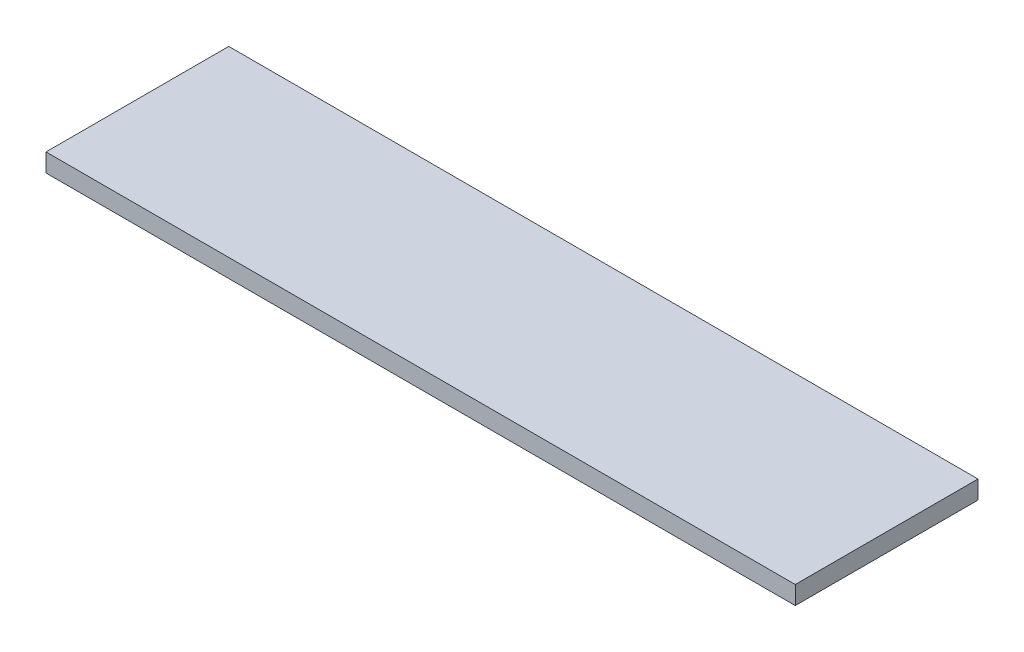
ISO-10303-21;
HEADER;
FILE_DESCRIPTION(('STEP AP214'),'2;1');
FILE_NAME('part.step','',(''),(''),'','','');
FILE_SCHEMA(('AUTOMOTIVE_DESIGN { 1 0 10303 214 1 1 1 1 }'));
ENDSEC;
DATA;
#1=APPLICATION_CONTEXT('core data for automotive mechanical design processes');
#2=APPLICATION_PROTOCOL_DEFINITION('international standard','automotive_design',2000,#1);
#3=PRODUCT_CONTEXT('',#1,'mechanical');
#4=PRODUCT('Part','Part','',(#3));
#5=PRODUCT_RELATED_PRODUCT_CATEGORY('part','',(#4));
#6=PRODUCT_DEFINITION_FORMATION('','',#4);
#7=PRODUCT_DEFINITION_CONTEXT('part definition',#1,'design');
#8=PRODUCT_DEFINITION('design','',#6,#7);
#9=PRODUCT_DEFINITION_SHAPE('','',#8);
#10=(LENGTH_UNIT() NAMED_UNIT(*) SI_UNIT(.MILLI.,.METRE.));
#11=(NAMED_UNIT(*) PLANE_ANGLE_UNIT() SI_UNIT($,.RADIAN.));
#12=(NAMED_UNIT(*) SI_UNIT($,.STERADIAN.) SOLID_ANGLE_UNIT());
#13=UNCERTAINTY_MEASURE_WITH_UNIT(LENGTH_MEASURE(1.E-05),#10,'distance_accuracy_value','');
#14=(GEOMETRIC_REPRESENTATION_CONTEXT(3) GLOBAL_UNCERTAINTY_ASSIGNED_CONTEXT((#13)) GLOBAL_UNIT_ASSIGNED_CONTEXT((#10,
#11,#12)) REPRESENTATION_CONTEXT('',''));
#15=CARTESIAN_POINT('',(0.,0.,0.));
#16=DIRECTION('',(0.,0.,1.));
#17=DIRECTION('',(1.,0.,0.));
#18=AXIS2_PLACEMENT_3D('',#15,#16,#17);
#19=CARTESIAN_POINT('',(-205.,10.,-50.));
#20=DIRECTION('',(1.,0.,0.));
#21=DIRECTION('',(0.,0.,-1.));
#22=AXIS2_PLACEMENT_3D('',#19,#20,#21);
#23=PLANE('',#22);
#24=DIRECTION('',(0.,0.,1.));
#25=VECTOR('',#24,1.);
#26=CARTESIAN_POINT('',(-205.,0.,-50.));
#27=LINE('',#26,#25);
#28=CARTESIAN_POINT('',(-205.,0.,-50.));
#29=VERTEX_POINT('',#28);
#30=CARTESIAN_POINT('',(-205.,0.,50.));
#31=VERTEX_POINT('',#30);
#32=EDGE_CURVE('E97',#29,#31,#27,.T.);
#33=ORIENTED_EDGE('',*,*,#32,.T.);
#34=DIRECTION('',(0.,-1.,0.));
#35=VECTOR('',#34,1.);
#36=CARTESIAN_POINT('',(-205.,10.,50.));
#37=LINE('',#36,#35);
#38=CARTESIAN_POINT('',(-205.,10.,50.));
#39=VERTEX_POINT('',#38);
#40=EDGE_CURVE('E11',#39,#31,#37,.T.);
#41=ORIENTED_EDGE('',*,*,#40,.F.);
#42=DIRECTION('',(0.,0.,1.));
#43=VECTOR('',#42,1.);
#44=CARTESIAN_POINT('',(-205.,10.,-50.));
#45=LINE('',#44,#43);
#46=CARTESIAN_POINT('',(-205.,10.,-50.));
#47=VERTEX_POINT('',#46);
#48=EDGE_CURVE('E85',#47,#39,#45,.T.);
#49=ORIENTED_EDGE('',*,*,#48,.F.);
#50=DIRECTION('',(0.,-1.,0.));
#51=VECTOR('',#50,1.);
#52=CARTESIAN_POINT('',(-205.,10.,-50.));
#53=LINE('',#52,#51);
#54=EDGE_CURVE('E93',#47,#29,#53,.T.);
#55=ORIENTED_EDGE('',*,*,#54,.T.);
#56=EDGE_LOOP('',(#33,#41,#49,#55));
#57=FACE_BOUND('',#56,.T.);
#58=ADVANCED_FACE('F34',(#57),#23,.F.);
#59=CARTESIAN_POINT('',(-205.,10.,50.));
#60=DIRECTION('',(0.,0.,-1.));
#61=DIRECTION('',(-1.,0.,0.));
#62=AXIS2_PLACEMENT_3D('',#59,#60,#61);
#63=PLANE('',#62);
#64=DIRECTION('',(1.,0.,0.));
#65=VECTOR('',#64,1.);
#66=CARTESIAN_POINT('',(-205.,0.,50.));
#67=LINE('',#66,#65);
#68=CARTESIAN_POINT('',(205.,0.,50.));
#69=VERTEX_POINT('',#68);
#70=EDGE_CURVE('E89',#31,#69,#67,.T.);
#71=ORIENTED_EDGE('',*,*,#70,.T.);
#72=DIRECTION('',(0.,-1.,0.));
#73=VECTOR('',#72,1.);
#74=CARTESIAN_POINT('',(205.,10.,50.));
#75=LINE('',#74,#73);
#76=CARTESIAN_POINT('',(205.,10.,50.));
#77=VERTEX_POINT('',#76);
#78=EDGE_CURVE('E42',#77,#69,#75,.T.);
#79=ORIENTED_EDGE('',*,*,#78,.F.);
#80=DIRECTION('',(1.,0.,0.));
#81=VECTOR('',#80,1.);
#82=CARTESIAN_POINT('',(-205.,10.,50.));
#83=LINE('',#82,#81);
#84=EDGE_CURVE('E80',#39,#77,#83,.T.);
#85=ORIENTED_EDGE('',*,*,#84,.F.);
#86=ORIENTED_EDGE('',*,*,#40,.T.);
#87=EDGE_LOOP('',(#71,#79,#85,#86));
#88=FACE_BOUND('',#87,.T.);
#89=ADVANCED_FACE('F88',(#88),#63,.F.);
#90=CARTESIAN_POINT('',(205.,10.,-50.));
#91=DIRECTION('',(-1.,0.,0.));
#92=DIRECTION('',(0.,0.,1.));
#93=AXIS2_PLACEMENT_3D('',#90,#91,#92);
#94=PLANE('',#93);
#95=DIRECTION('',(0.,0.,-1.));
#96=VECTOR('',#95,1.);
#97=CARTESIAN_POINT('',(205.,0.,-50.));
#98=LINE('',#97,#96);
#99=CARTESIAN_POINT('',(205.,0.,-50.));
#100=VERTEX_POINT('',#99);
#101=EDGE_CURVE('E67',#69,#100,#98,.T.);
#102=ORIENTED_EDGE('',*,*,#101,.T.);
#103=DIRECTION('',(0.,-1.,0.));
#104=VECTOR('',#103,1.);
#105=CARTESIAN_POINT('',(205.,10.,-50.));
#106=LINE('',#105,#104);
#107=CARTESIAN_POINT('',(205.,10.,-50.));
#108=VERTEX_POINT('',#107);
#109=EDGE_CURVE('E90',#108,#100,#106,.T.);
#110=ORIENTED_EDGE('',*,*,#109,.F.);
#111=DIRECTION('',(0.,0.,-1.));
#112=VECTOR('',#111,1.);
#113=CARTESIAN_POINT('',(205.,10.,-50.));
#114=LINE('',#113,#112);
#115=EDGE_CURVE('E83',#77,#108,#114,.T.);
#116=ORIENTED_EDGE('',*,*,#115,.F.);
#117=ORIENTED_EDGE('',*,*,#78,.T.);
#118=EDGE_LOOP('',(#102,#110,#116,#117));
#119=FACE_BOUND('',#118,.T.);
#120=ADVANCED_FACE('F91',(#119),#94,.F.);
#121=CARTESIAN_POINT('',(-205.,10.,-50.));
#122=DIRECTION('',(0.,0.,1.));
#123=DIRECTION('',(1.,0.,0.));
#124=AXIS2_PLACEMENT_3D('',#121,#122,#123);
#125=PLANE('',#124);
#126=DIRECTION('',(-1.,0.,0.));
#127=VECTOR('',#126,1.);
#128=CARTESIAN_POINT('',(-205.,0.,-50.));
#129=LINE('',#128,#127);
#130=EDGE_CURVE('E73',#100,#29,#129,.T.);
#131=ORIENTED_EDGE('',*,*,#130,.T.);
#132=ORIENTED_EDGE('',*,*,#54,.F.);
#133=DIRECTION('',(-1.,0.,0.));
#134=VECTOR('',#133,1.);
#135=CARTESIAN_POINT('',(-205.,10.,-50.));
#136=LINE('',#135,#134);
#137=EDGE_CURVE('E50',#108,#47,#136,.T.);
#138=ORIENTED_EDGE('',*,*,#137,.F.);
#139=ORIENTED_EDGE('',*,*,#109,.T.);
#140=EDGE_LOOP('',(#131,#132,#138,#139));
#141=FACE_BOUND('',#140,.T.);
#142=ADVANCED_FACE('F104',(#141),#125,.F.);
#143=CARTESIAN_POINT('',(0.,10.,0.));
#144=DIRECTION('',(0.,1.,0.));
#145=DIRECTION('',(0.,0.,1.));
#146=AXIS2_PLACEMENT_3D('',#143,#144,#145);
#147=PLANE('',#146);
#148=ORIENTED_EDGE('',*,*,#48,.T.);
#149=ORIENTED_EDGE('',*,*,#84,.T.);
#150=ORIENTED_EDGE('',*,*,#115,.T.);
#151=ORIENTED_EDGE('',*,*,#137,.T.);
#152=EDGE_LOOP('',(#148,#149,#150,#151));
#153=FACE_BOUND('',#152,.T.);
#154=ADVANCED_FACE('F81',(#153),#147,.T.);
#155=CARTESIAN_POINT('',(0.,0.,0.));
#156=DIRECTION('',(0.,1.,0.));
#157=DIRECTION('',(0.,0.,1.));
#158=AXIS2_PLACEMENT_3D('',#155,#156,#157);
#159=PLANE('',#158);
#160=ORIENTED_EDGE('',*,*,#32,.F.);
#161=ORIENTED_EDGE('',*,*,#130,.F.);
#162=ORIENTED_EDGE('',*,*,#101,.F.);
#163=ORIENTED_EDGE('',*,*,#70,.F.);
#164=EDGE_LOOP('',(#160,#161,#162,#163));
#165=FACE_BOUND('',#164,.T.);
#166=ADVANCED_FACE('F107',(#165),#159,.F.);
#167=CLOSED_SHELL('',(#58,#89,#120,#142,#154,#166));
#168=MANIFOLD_SOLID_BREP('B2',#167);
#169=ADVANCED_BREP_SHAPE_REPRESENTATION('',(#18,#168),#14);
#170=SHAPE_DEFINITION_REPRESENTATION(#9,#169);
ENDSEC;
END-ISO-10303-21;
